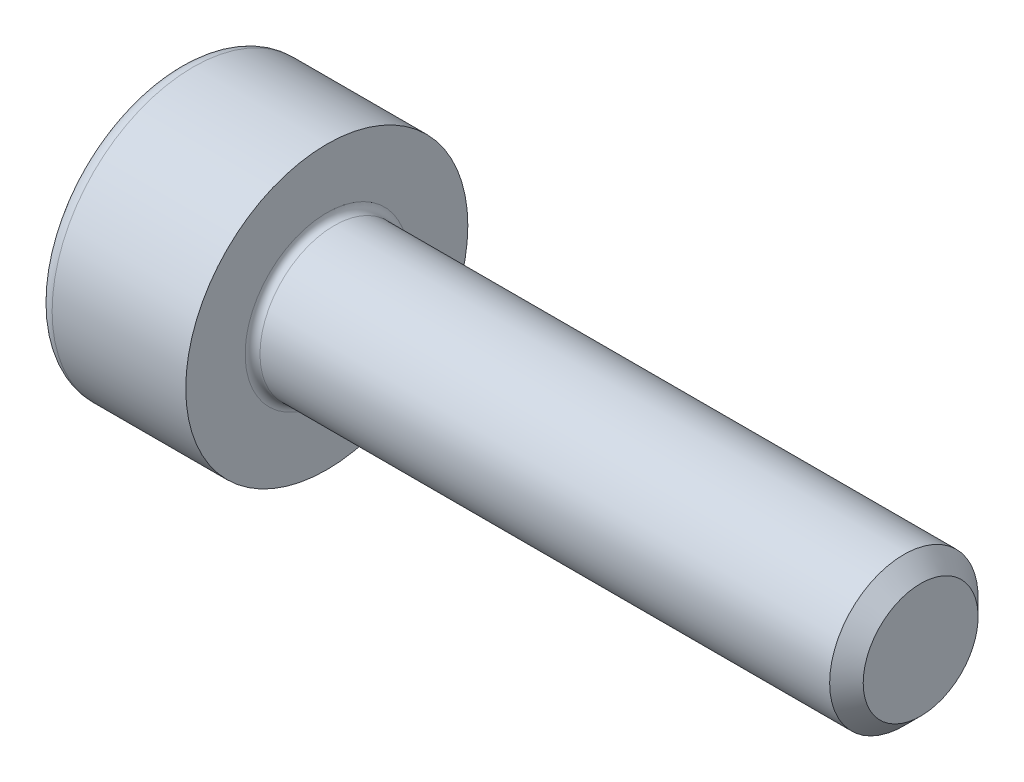
ISO-10303-21;
HEADER;
FILE_DESCRIPTION(('STEP AP214'),'2;1');
FILE_NAME('part.step','',(''),(''),'','','');
FILE_SCHEMA(('AUTOMOTIVE_DESIGN { 1 0 10303 214 1 1 1 1 }'));
ENDSEC;
DATA;
#1=APPLICATION_CONTEXT('core data for automotive mechanical design processes');
#2=APPLICATION_PROTOCOL_DEFINITION('international standard','automotive_design',2000,#1);
#3=PRODUCT_CONTEXT('',#1,'mechanical');
#4=PRODUCT('Part','Part','',(#3));
#5=PRODUCT_RELATED_PRODUCT_CATEGORY('part','',(#4));
#6=PRODUCT_DEFINITION_FORMATION('','',#4);
#7=PRODUCT_DEFINITION_CONTEXT('part definition',#1,'design');
#8=PRODUCT_DEFINITION('design','',#6,#7);
#9=PRODUCT_DEFINITION_SHAPE('','',#8);
#10=(LENGTH_UNIT() NAMED_UNIT(*) SI_UNIT(.MILLI.,.METRE.));
#11=(NAMED_UNIT(*) PLANE_ANGLE_UNIT() SI_UNIT($,.RADIAN.));
#12=(NAMED_UNIT(*) SI_UNIT($,.STERADIAN.) SOLID_ANGLE_UNIT());
#13=UNCERTAINTY_MEASURE_WITH_UNIT(LENGTH_MEASURE(1.E-05),#10,'distance_accuracy_value','');
#14=(GEOMETRIC_REPRESENTATION_CONTEXT(3) GLOBAL_UNCERTAINTY_ASSIGNED_CONTEXT((#13)) GLOBAL_UNIT_ASSIGNED_CONTEXT((#10,
#11,#12)) REPRESENTATION_CONTEXT('',''));
#15=CARTESIAN_POINT('',(0.,0.,0.));
#16=DIRECTION('',(0.,0.,1.));
#17=DIRECTION('',(1.,0.,0.));
#18=AXIS2_PLACEMENT_3D('',#15,#16,#17);
#19=CARTESIAN_POINT('',(0.,0.,0.));
#20=DIRECTION('',(-1.,0.,0.));
#21=DIRECTION('',(0.,0.,1.));
#22=AXIS2_PLACEMENT_3D('',#19,#20,#21);
#23=PLANE('',#22);
#24=DIRECTION('',(0.,-0.499999999999999,0.866025403784439));
#25=VECTOR('',#24,1.);
#26=CARTESIAN_POINT('',(0.,0.877572409168225,0.));
#27=LINE('',#26,#25);
#28=CARTESIAN_POINT('',(0.,0.877572409168225,0.));
#29=VERTEX_POINT('',#28);
#30=CARTESIAN_POINT('',(0.,0.43878620458411,0.759999999999998));
#31=VERTEX_POINT('',#30);
#32=EDGE_CURVE('E262',#29,#31,#27,.T.);
#33=ORIENTED_EDGE('',*,*,#32,.T.);
#34=DIRECTION('',(0.,1.,0.));
#35=VECTOR('',#34,1.);
#36=CARTESIAN_POINT('',(0.,-0.438786204584121,0.759999999999999));
#37=LINE('',#36,#35);
#38=CARTESIAN_POINT('',(0.,-0.438786204584121,0.759999999999999));
#39=VERTEX_POINT('',#38);
#40=EDGE_CURVE('E134',#39,#31,#37,.T.);
#41=ORIENTED_EDGE('',*,*,#40,.F.);
#42=DIRECTION('',(0.,-0.500000000000001,-0.866025403784438));
#43=VECTOR('',#42,1.);
#44=CARTESIAN_POINT('',(0.,-0.438786204584121,0.759999999999999));
#45=LINE('',#44,#43);
#46=CARTESIAN_POINT('',(0.,-0.877572409168237,0.));
#47=VERTEX_POINT('',#46);
#48=EDGE_CURVE('E265',#39,#47,#45,.T.);
#49=ORIENTED_EDGE('',*,*,#48,.T.);
#50=DIRECTION('',(0.,0.499999999999998,-0.86602540378444));
#51=VECTOR('',#50,1.);
#52=CARTESIAN_POINT('',(0.,-0.877572409168237,0.));
#53=LINE('',#52,#51);
#54=CARTESIAN_POINT('',(0.,-0.438786204584123,-0.760000000000001));
#55=VERTEX_POINT('',#54);
#56=EDGE_CURVE('E268',#47,#55,#53,.T.);
#57=ORIENTED_EDGE('',*,*,#56,.T.);
#58=DIRECTION('',(0.,-1.,0.));
#59=VECTOR('',#58,1.);
#60=CARTESIAN_POINT('',(0.,0.438786204584108,-0.760000000000002));
#61=LINE('',#60,#59);
#62=CARTESIAN_POINT('',(0.,0.438786204584108,-0.760000000000002));
#63=VERTEX_POINT('',#62);
#64=EDGE_CURVE('E271',#63,#55,#61,.T.);
#65=ORIENTED_EDGE('',*,*,#64,.F.);
#66=DIRECTION('',(0.,-0.500000000000001,-0.866025403784438));
#67=VECTOR('',#66,1.);
#68=CARTESIAN_POINT('',(0.,0.877572409168225,0.));
#69=LINE('',#68,#67);
#70=EDGE_CURVE('E129',#29,#63,#69,.T.);
#71=ORIENTED_EDGE('',*,*,#70,.F.);
#72=EDGE_LOOP('',(#33,#41,#49,#57,#65,#71));
#73=FACE_BOUND('',#72,.T.);
#74=CARTESIAN_POINT('',(0.,0.,0.));
#75=DIRECTION('',(-1.,0.,0.));
#76=DIRECTION('',(0.,0.,1.));
#77=AXIS2_PLACEMENT_3D('',#74,#75,#76);
#78=CIRCLE('',#77,1.7);
#79=CARTESIAN_POINT('',(0.,0.,1.7));
#80=VERTEX_POINT('',#79);
#81=EDGE_CURVE('E46',#80,#80,#78,.T.);
#82=ORIENTED_EDGE('',*,*,#81,.T.);
#83=EDGE_LOOP('',(#82));
#84=FACE_BOUND('',#83,.T.);
#85=ADVANCED_FACE('F38',(#73,#84),#23,.T.);
#86=CARTESIAN_POINT('',(-31.75,0.,0.));
#87=DIRECTION('',(-1.,0.,0.));
#88=DIRECTION('',(0.,0.,1.));
#89=AXIS2_PLACEMENT_3D('',#86,#87,#88);
#90=CYLINDRICAL_SURFACE('',#89,1.9);
#91=CARTESIAN_POINT('',(0.199999999999999,0.,0.));
#92=DIRECTION('',(-1.,0.,0.));
#93=DIRECTION('',(0.,0.,1.));
#94=AXIS2_PLACEMENT_3D('',#91,#92,#93);
#95=CIRCLE('',#94,1.9);
#96=CARTESIAN_POINT('',(0.199999999999999,0.,1.9));
#97=VERTEX_POINT('',#96);
#98=EDGE_CURVE('E11',#97,#97,#95,.F.);
#99=ORIENTED_EDGE('',*,*,#98,.T.);
#100=EDGE_LOOP('',(#99));
#101=FACE_BOUND('',#100,.T.);
#102=CARTESIAN_POINT('',(2.,0.,0.));
#103=DIRECTION('',(-1.,0.,0.));
#104=DIRECTION('',(0.,0.,1.));
#105=AXIS2_PLACEMENT_3D('',#102,#103,#104);
#106=CIRCLE('',#105,1.9);
#107=CARTESIAN_POINT('',(2.,0.,1.9));
#108=VERTEX_POINT('',#107);
#109=EDGE_CURVE('E152',#108,#108,#106,.T.);
#110=ORIENTED_EDGE('',*,*,#109,.T.);
#111=EDGE_LOOP('',(#110));
#112=FACE_BOUND('',#111,.T.);
#113=ADVANCED_FACE('F176',(#101,#112),#90,.T.);
#114=CARTESIAN_POINT('',(2.,1.9,0.));
#115=DIRECTION('',(1.,0.,0.));
#116=DIRECTION('',(0.,0.,-1.));
#117=AXIS2_PLACEMENT_3D('',#114,#115,#116);
#118=PLANE('',#117);
#119=CARTESIAN_POINT('',(2.,0.,0.));
#120=DIRECTION('',(1.,0.,0.));
#121=DIRECTION('',(0.,0.,-1.));
#122=AXIS2_PLACEMENT_3D('',#119,#120,#121);
#123=CIRCLE('',#122,1.1);
#124=CARTESIAN_POINT('',(2.,0.,-1.1));
#125=VERTEX_POINT('',#124);
#126=EDGE_CURVE('E155',#125,#125,#123,.F.);
#127=ORIENTED_EDGE('',*,*,#126,.T.);
#128=EDGE_LOOP('',(#127));
#129=FACE_BOUND('',#128,.T.);
#130=ORIENTED_EDGE('',*,*,#109,.F.);
#131=EDGE_LOOP('',(#130));
#132=FACE_BOUND('',#131,.T.);
#133=ADVANCED_FACE('F182',(#129,#132),#118,.T.);
#134=CARTESIAN_POINT('',(-31.75,0.,0.));
#135=DIRECTION('',(-1.,0.,0.));
#136=DIRECTION('',(0.,0.,1.));
#137=AXIS2_PLACEMENT_3D('',#134,#135,#136);
#138=CYLINDRICAL_SURFACE('',#137,1.);
#139=CARTESIAN_POINT('',(2.1,0.,0.));
#140=DIRECTION('',(1.,0.,0.));
#141=DIRECTION('',(0.,0.,-1.));
#142=AXIS2_PLACEMENT_3D('',#139,#140,#141);
#143=CIRCLE('',#142,1.);
#144=CARTESIAN_POINT('',(2.1,0.,-1.));
#145=VERTEX_POINT('',#144);
#146=EDGE_CURVE('E158',#145,#145,#143,.T.);
#147=ORIENTED_EDGE('',*,*,#146,.T.);
#148=EDGE_LOOP('',(#147));
#149=FACE_BOUND('',#148,.T.);
#150=CARTESIAN_POINT('',(9.774,0.,0.));
#151=DIRECTION('',(-1.,0.,0.));
#152=DIRECTION('',(0.,0.,1.));
#153=AXIS2_PLACEMENT_3D('',#150,#151,#152);
#154=CIRCLE('',#153,1.);
#155=CARTESIAN_POINT('',(9.774,0.,1.));
#156=VERTEX_POINT('',#155);
#157=EDGE_CURVE('E149',#156,#156,#154,.T.);
#158=ORIENTED_EDGE('',*,*,#157,.T.);
#159=EDGE_LOOP('',(#158));
#160=FACE_BOUND('',#159,.T.);
#161=ADVANCED_FACE('F188',(#149,#160),#138,.T.);
#162=CARTESIAN_POINT('',(10.,0.,0.));
#163=DIRECTION('',(-1.,0.,0.));
#164=DIRECTION('',(0.,0.,1.));
#165=AXIS2_PLACEMENT_3D('',#162,#163,#164);
#166=CONICAL_SURFACE('',#165,0.774,0.785398163397454);
#167=ORIENTED_EDGE('',*,*,#157,.F.);
#168=EDGE_LOOP('',(#167));
#169=FACE_BOUND('',#168,.T.);
#170=CARTESIAN_POINT('',(10.,0.,0.));
#171=DIRECTION('',(-1.,0.,0.));
#172=DIRECTION('',(0.,0.,1.));
#173=AXIS2_PLACEMENT_3D('',#170,#171,#172);
#174=CIRCLE('',#173,0.774);
#175=CARTESIAN_POINT('',(10.,0.,0.774));
#176=VERTEX_POINT('',#175);
#177=EDGE_CURVE('E145',#176,#176,#174,.T.);
#178=ORIENTED_EDGE('',*,*,#177,.T.);
#179=EDGE_LOOP('',(#178));
#180=FACE_BOUND('',#179,.T.);
#181=ADVANCED_FACE('F192',(#169,#180),#166,.T.);
#182=CARTESIAN_POINT('',(10.,0.774,0.));
#183=DIRECTION('',(1.,0.,0.));
#184=DIRECTION('',(0.,0.,-1.));
#185=AXIS2_PLACEMENT_3D('',#182,#183,#184);
#186=PLANE('',#185);
#187=ORIENTED_EDGE('',*,*,#177,.F.);
#188=EDGE_LOOP('',(#187));
#189=FACE_BOUND('',#188,.T.);
#190=ADVANCED_FACE('F172',(#189),#186,.T.);
#191=CARTESIAN_POINT('',(2.1,0.,0.));
#192=DIRECTION('',(1.,0.,0.));
#193=DIRECTION('',(0.,0.,-1.));
#194=AXIS2_PLACEMENT_3D('',#191,#192,#193);
#195=TOROIDAL_SURFACE('',#194,1.1,0.1);
#196=ORIENTED_EDGE('',*,*,#146,.F.);
#197=EDGE_LOOP('',(#196));
#198=FACE_BOUND('',#197,.T.);
#199=ORIENTED_EDGE('',*,*,#126,.F.);
#200=EDGE_LOOP('',(#199));
#201=FACE_BOUND('',#200,.T.);
#202=ADVANCED_FACE('F165',(#198,#201),#195,.F.);
#203=CARTESIAN_POINT('',(0.199999999999999,0.,0.));
#204=DIRECTION('',(-1.,0.,0.));
#205=DIRECTION('',(0.,0.,1.));
#206=AXIS2_PLACEMENT_3D('',#203,#204,#205);
#207=TOROIDAL_SURFACE('',#206,1.7,0.2);
#208=ORIENTED_EDGE('',*,*,#98,.F.);
#209=EDGE_LOOP('',(#208));
#210=FACE_BOUND('',#209,.T.);
#211=ORIENTED_EDGE('',*,*,#81,.F.);
#212=EDGE_LOOP('',(#211));
#213=FACE_BOUND('',#212,.T.);
#214=ADVANCED_FACE('F40',(#210,#213),#207,.T.);
#215=CARTESIAN_POINT('',(1.,0.877572409168225,0.));
#216=DIRECTION('',(0.,-0.866025403784439,-0.499999999999999));
#217=DIRECTION('',(0.,0.499999999999999,-0.866025403784439));
#218=AXIS2_PLACEMENT_3D('',#215,#216,#217);
#219=PLANE('',#218);
#220=ORIENTED_EDGE('',*,*,#32,.F.);
#221=DIRECTION('',(-1.,0.,0.));
#222=VECTOR('',#221,1.);
#223=CARTESIAN_POINT('',(1.,0.877572409168225,0.));
#224=LINE('',#223,#222);
#225=CARTESIAN_POINT('',(1.,0.877572409168225,0.));
#226=VERTEX_POINT('',#225);
#227=EDGE_CURVE('E252',#226,#29,#224,.T.);
#228=ORIENTED_EDGE('',*,*,#227,.F.);
#229=DIRECTION('',(0.,-0.499999999999999,0.866025403784439));
#230=VECTOR('',#229,1.);
#231=CARTESIAN_POINT('',(1.,0.877572409168225,0.));
#232=LINE('',#231,#230);
#233=CARTESIAN_POINT('',(1.,0.658179306876169,0.379999999999996));
#234=VERTEX_POINT('',#233);
#235=EDGE_CURVE('E121',#226,#234,#232,.T.);
#236=ORIENTED_EDGE('',*,*,#235,.T.);
#237=CARTESIAN_POINT('',(1.,0.43878620458411,0.759999999999998));
#238=VERTEX_POINT('',#237);
#239=EDGE_CURVE('E112',#234,#238,#232,.T.);
#240=ORIENTED_EDGE('',*,*,#239,.T.);
#241=DIRECTION('',(-1.,0.,0.));
#242=VECTOR('',#241,1.);
#243=CARTESIAN_POINT('',(1.,0.43878620458411,0.759999999999998));
#244=LINE('',#243,#242);
#245=EDGE_CURVE('E126',#238,#31,#244,.T.);
#246=ORIENTED_EDGE('',*,*,#245,.T.);
#247=EDGE_LOOP('',(#220,#228,#236,#240,#246));
#248=FACE_BOUND('',#247,.T.);
#249=ADVANCED_FACE('F125',(#248),#219,.T.);
#250=CARTESIAN_POINT('',(1.,-0.438786204584121,0.759999999999999));
#251=DIRECTION('',(0.,0.,1.));
#252=DIRECTION('',(0.,-1.,0.));
#253=AXIS2_PLACEMENT_3D('',#250,#251,#252);
#254=PLANE('',#253);
#255=ORIENTED_EDGE('',*,*,#40,.T.);
#256=ORIENTED_EDGE('',*,*,#245,.F.);
#257=DIRECTION('',(0.,1.,0.));
#258=VECTOR('',#257,1.);
#259=CARTESIAN_POINT('',(1.,-0.438786204584121,0.759999999999999));
#260=LINE('',#259,#258);
#261=CARTESIAN_POINT('',(1.,0.,0.759999999999998));
#262=VERTEX_POINT('',#261);
#263=EDGE_CURVE('E109',#262,#238,#260,.T.);
#264=ORIENTED_EDGE('',*,*,#263,.F.);
#265=CARTESIAN_POINT('',(1.,-0.438786204584121,0.759999999999999));
#266=VERTEX_POINT('',#265);
#267=EDGE_CURVE('E120',#266,#262,#260,.T.);
#268=ORIENTED_EDGE('',*,*,#267,.F.);
#269=DIRECTION('',(-1.,0.,0.));
#270=VECTOR('',#269,1.);
#271=CARTESIAN_POINT('',(1.,-0.438786204584121,0.759999999999999));
#272=LINE('',#271,#270);
#273=EDGE_CURVE('E136',#266,#39,#272,.T.);
#274=ORIENTED_EDGE('',*,*,#273,.T.);
#275=EDGE_LOOP('',(#255,#256,#264,#268,#274));
#276=FACE_BOUND('',#275,.T.);
#277=ADVANCED_FACE('F131',(#276),#254,.F.);
#278=CARTESIAN_POINT('',(1.,-0.438786204584121,0.759999999999999));
#279=DIRECTION('',(0.,0.866025403784438,-0.500000000000001));
#280=DIRECTION('',(0.,0.500000000000001,0.866025403784438));
#281=AXIS2_PLACEMENT_3D('',#278,#279,#280);
#282=PLANE('',#281);
#283=ORIENTED_EDGE('',*,*,#48,.F.);
#284=ORIENTED_EDGE('',*,*,#273,.F.);
#285=DIRECTION('',(0.,-0.500000000000001,-0.866025403784438));
#286=VECTOR('',#285,1.);
#287=CARTESIAN_POINT('',(1.,-0.438786204584121,0.759999999999999));
#288=LINE('',#287,#286);
#289=CARTESIAN_POINT('',(1.,-0.658179306876177,0.380000000000003));
#290=VERTEX_POINT('',#289);
#291=EDGE_CURVE('E291',#266,#290,#288,.T.);
#292=ORIENTED_EDGE('',*,*,#291,.T.);
#293=CARTESIAN_POINT('',(1.,-0.877572409168237,0.));
#294=VERTEX_POINT('',#293);
#295=EDGE_CURVE('E280',#290,#294,#288,.T.);
#296=ORIENTED_EDGE('',*,*,#295,.T.);
#297=DIRECTION('',(-1.,0.,0.));
#298=VECTOR('',#297,1.);
#299=CARTESIAN_POINT('',(1.,-0.877572409168237,0.));
#300=LINE('',#299,#298);
#301=EDGE_CURVE('E141',#294,#47,#300,.T.);
#302=ORIENTED_EDGE('',*,*,#301,.T.);
#303=EDGE_LOOP('',(#283,#284,#292,#296,#302));
#304=FACE_BOUND('',#303,.T.);
#305=ADVANCED_FACE('F206',(#304),#282,.T.);
#306=CARTESIAN_POINT('',(1.,-0.877572409168237,0.));
#307=DIRECTION('',(0.,0.86602540378444,0.499999999999998));
#308=DIRECTION('',(0.,-0.499999999999998,0.86602540378444));
#309=AXIS2_PLACEMENT_3D('',#306,#307,#308);
#310=PLANE('',#309);
#311=ORIENTED_EDGE('',*,*,#56,.F.);
#312=ORIENTED_EDGE('',*,*,#301,.F.);
#313=DIRECTION('',(0.,0.499999999999998,-0.86602540378444));
#314=VECTOR('',#313,1.);
#315=CARTESIAN_POINT('',(1.,-0.877572409168237,0.));
#316=LINE('',#315,#314);
#317=CARTESIAN_POINT('',(1.,-0.65817930687618,-0.380000000000002));
#318=VERTEX_POINT('',#317);
#319=EDGE_CURVE('E258',#294,#318,#316,.T.);
#320=ORIENTED_EDGE('',*,*,#319,.T.);
#321=CARTESIAN_POINT('',(1.,-0.438786204584123,-0.760000000000001));
#322=VERTEX_POINT('',#321);
#323=EDGE_CURVE('E290',#318,#322,#316,.T.);
#324=ORIENTED_EDGE('',*,*,#323,.T.);
#325=DIRECTION('',(-1.,0.,0.));
#326=VECTOR('',#325,1.);
#327=CARTESIAN_POINT('',(1.,-0.438786204584123,-0.760000000000001));
#328=LINE('',#327,#326);
#329=EDGE_CURVE('E251',#322,#55,#328,.T.);
#330=ORIENTED_EDGE('',*,*,#329,.T.);
#331=EDGE_LOOP('',(#311,#312,#320,#324,#330));
#332=FACE_BOUND('',#331,.T.);
#333=ADVANCED_FACE('F209',(#332),#310,.T.);
#334=CARTESIAN_POINT('',(1.,0.438786204584108,-0.760000000000002));
#335=DIRECTION('',(0.,0.,-1.));
#336=DIRECTION('',(0.,1.,0.));
#337=AXIS2_PLACEMENT_3D('',#334,#335,#336);
#338=PLANE('',#337);
#339=ORIENTED_EDGE('',*,*,#64,.T.);
#340=ORIENTED_EDGE('',*,*,#329,.F.);
#341=DIRECTION('',(0.,-1.,0.));
#342=VECTOR('',#341,1.);
#343=CARTESIAN_POINT('',(1.,0.438786204584108,-0.760000000000002));
#344=LINE('',#343,#342);
#345=CARTESIAN_POINT('',(1.,0.,-0.76));
#346=VERTEX_POINT('',#345);
#347=EDGE_CURVE('E255',#346,#322,#344,.T.);
#348=ORIENTED_EDGE('',*,*,#347,.F.);
#349=CARTESIAN_POINT('',(1.,0.438786204584108,-0.760000000000002));
#350=VERTEX_POINT('',#349);
#351=EDGE_CURVE('E53',#350,#346,#344,.T.);
#352=ORIENTED_EDGE('',*,*,#351,.F.);
#353=DIRECTION('',(-1.,0.,0.));
#354=VECTOR('',#353,1.);
#355=CARTESIAN_POINT('',(1.,0.438786204584108,-0.760000000000002));
#356=LINE('',#355,#354);
#357=EDGE_CURVE('E248',#350,#63,#356,.T.);
#358=ORIENTED_EDGE('',*,*,#357,.T.);
#359=EDGE_LOOP('',(#339,#340,#348,#352,#358));
#360=FACE_BOUND('',#359,.T.);
#361=ADVANCED_FACE('F213',(#360),#338,.F.);
#362=CARTESIAN_POINT('',(1.,0.877572409168225,0.));
#363=DIRECTION('',(0.,0.866025403784438,-0.500000000000001));
#364=DIRECTION('',(0.,0.500000000000001,0.866025403784438));
#365=AXIS2_PLACEMENT_3D('',#362,#363,#364);
#366=PLANE('',#365);
#367=ORIENTED_EDGE('',*,*,#70,.T.);
#368=ORIENTED_EDGE('',*,*,#357,.F.);
#369=DIRECTION('',(0.,-0.500000000000001,-0.866025403784438));
#370=VECTOR('',#369,1.);
#371=CARTESIAN_POINT('',(1.,0.877572409168225,0.));
#372=LINE('',#371,#370);
#373=CARTESIAN_POINT('',(1.,0.658179306876169,-0.379999999999999));
#374=VERTEX_POINT('',#373);
#375=EDGE_CURVE('E238',#374,#350,#372,.T.);
#376=ORIENTED_EDGE('',*,*,#375,.F.);
#377=EDGE_CURVE('E244',#226,#374,#372,.T.);
#378=ORIENTED_EDGE('',*,*,#377,.F.);
#379=ORIENTED_EDGE('',*,*,#227,.T.);
#380=EDGE_LOOP('',(#367,#368,#376,#378,#379));
#381=FACE_BOUND('',#380,.T.);
#382=ADVANCED_FACE('F217',(#381),#366,.F.);
#383=CARTESIAN_POINT('',(1.,1.31635861375234,-0.760000000000003));
#384=DIRECTION('',(1.,0.,0.));
#385=DIRECTION('',(0.,0.,-1.));
#386=AXIS2_PLACEMENT_3D('',#383,#384,#385);
#387=PLANE('',#386);
#388=ORIENTED_EDGE('',*,*,#347,.T.);
#389=ORIENTED_EDGE('',*,*,#323,.F.);
#390=CARTESIAN_POINT('',(1.,0.,0.));
#391=DIRECTION('',(-1.,0.,0.));
#392=DIRECTION('',(0.,0.,1.));
#393=AXIS2_PLACEMENT_3D('',#390,#391,#392);
#394=CIRCLE('',#393,0.76);
#395=EDGE_CURVE('E286',#346,#318,#394,.T.);
#396=ORIENTED_EDGE('',*,*,#395,.F.);
#397=EDGE_LOOP('',(#388,#389,#396));
#398=FACE_BOUND('',#397,.T.);
#399=ADVANCED_FACE('F221',(#398),#387,.F.);
#400=ORIENTED_EDGE('',*,*,#319,.F.);
#401=ORIENTED_EDGE('',*,*,#295,.F.);
#402=EDGE_CURVE('E139',#318,#290,#394,.T.);
#403=ORIENTED_EDGE('',*,*,#402,.F.);
#404=EDGE_LOOP('',(#400,#401,#403));
#405=FACE_BOUND('',#404,.T.);
#406=ADVANCED_FACE('F224',(#405),#387,.F.);
#407=ORIENTED_EDGE('',*,*,#291,.F.);
#408=ORIENTED_EDGE('',*,*,#267,.T.);
#409=EDGE_CURVE('E135',#290,#262,#394,.T.);
#410=ORIENTED_EDGE('',*,*,#409,.F.);
#411=EDGE_LOOP('',(#407,#408,#410));
#412=FACE_BOUND('',#411,.T.);
#413=ADVANCED_FACE('F229',(#412),#387,.F.);
#414=ORIENTED_EDGE('',*,*,#263,.T.);
#415=ORIENTED_EDGE('',*,*,#239,.F.);
#416=EDGE_CURVE('E115',#262,#234,#394,.T.);
#417=ORIENTED_EDGE('',*,*,#416,.F.);
#418=EDGE_LOOP('',(#414,#415,#417));
#419=FACE_BOUND('',#418,.T.);
#420=ADVANCED_FACE('F111',(#419),#387,.F.);
#421=ORIENTED_EDGE('',*,*,#235,.F.);
#422=ORIENTED_EDGE('',*,*,#377,.T.);
#423=EDGE_CURVE('E146',#234,#374,#394,.T.);
#424=ORIENTED_EDGE('',*,*,#423,.F.);
#425=EDGE_LOOP('',(#421,#422,#424));
#426=FACE_BOUND('',#425,.T.);
#427=ADVANCED_FACE('F232',(#426),#387,.F.);
#428=ORIENTED_EDGE('',*,*,#375,.T.);
#429=ORIENTED_EDGE('',*,*,#351,.T.);
#430=EDGE_CURVE('E241',#374,#346,#394,.T.);
#431=ORIENTED_EDGE('',*,*,#430,.F.);
#432=EDGE_LOOP('',(#428,#429,#431));
#433=FACE_BOUND('',#432,.T.);
#434=ADVANCED_FACE('F202',(#433),#387,.F.);
#435=CARTESIAN_POINT('',(1.,0.,0.));
#436=DIRECTION('',(-1.,0.,0.));
#437=DIRECTION('',(0.,0.,1.));
#438=AXIS2_PLACEMENT_3D('',#435,#436,#437);
#439=CONICAL_SURFACE('',#438,0.76,1.0471975511966);
#440=CARTESIAN_POINT('',(1.43878620458412,0.,0.));
#441=VERTEX_POINT('',#440);
#442=VERTEX_LOOP('',#441);
#443=FACE_BOUND('',#442,.T.);
#444=ORIENTED_EDGE('',*,*,#416,.T.);
#445=ORIENTED_EDGE('',*,*,#423,.T.);
#446=ORIENTED_EDGE('',*,*,#430,.T.);
#447=ORIENTED_EDGE('',*,*,#395,.T.);
#448=ORIENTED_EDGE('',*,*,#402,.T.);
#449=ORIENTED_EDGE('',*,*,#409,.T.);
#450=EDGE_LOOP('',(#444,#445,#446,#447,#448,#449));
#451=FACE_BOUND('',#450,.T.);
#452=ADVANCED_FACE('F200',(#443,#451),#439,.F.);
#453=CLOSED_SHELL('',(#85,#113,#133,#161,#181,#190,#202,#214,#249,#277,#305,#333,#361,#382,#399,
#406,#413,#420,#427,#434,#452));
#454=MANIFOLD_SOLID_BREP('B2',#453);
#455=ADVANCED_BREP_SHAPE_REPRESENTATION('',(#18,#454),#14);
#456=SHAPE_DEFINITION_REPRESENTATION(#9,#455);
ENDSEC;
END-ISO-10303-21;
